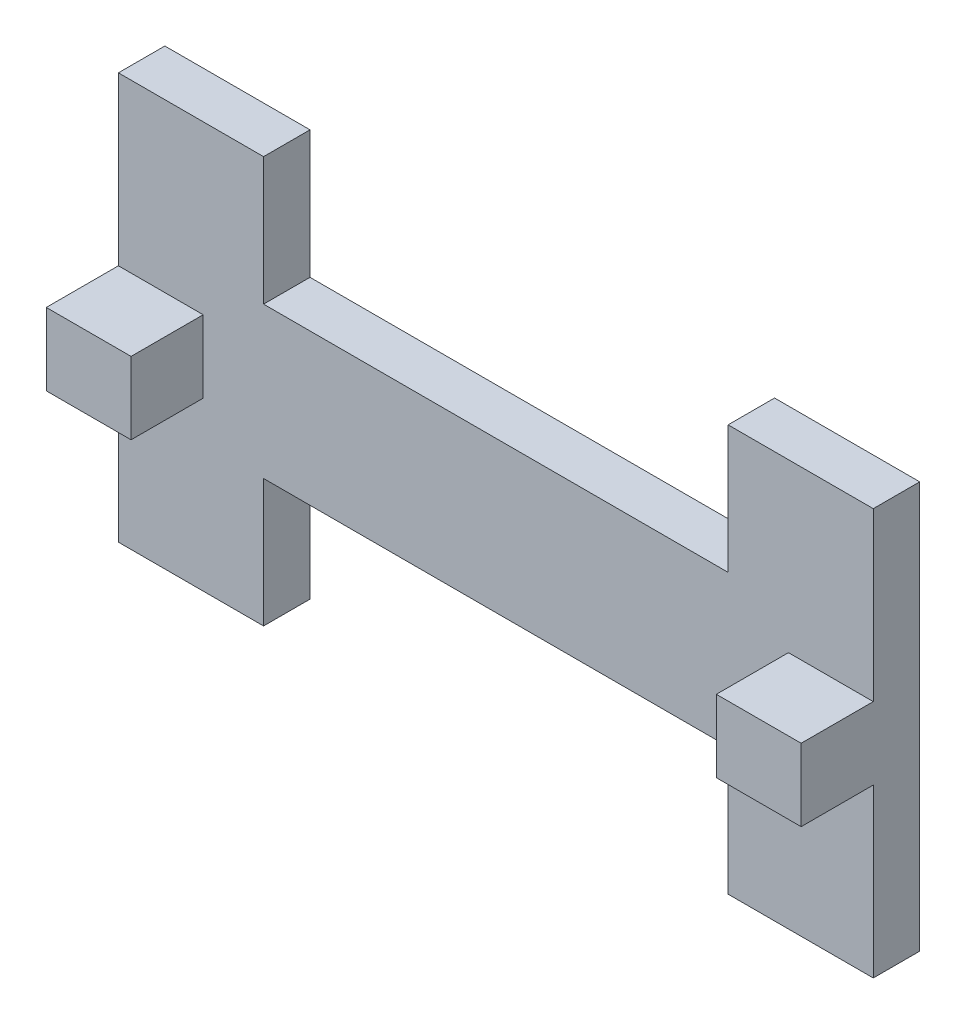
ISO-10303-21;
HEADER;
FILE_DESCRIPTION(('STEP AP214'),'2;1');
FILE_NAME('part.step','',(''),(''),'','','');
FILE_SCHEMA(('AUTOMOTIVE_DESIGN { 1 0 10303 214 1 1 1 1 }'));
ENDSEC;
DATA;
#1=APPLICATION_CONTEXT('core data for automotive mechanical design processes');
#2=APPLICATION_PROTOCOL_DEFINITION('international standard','automotive_design',2000,#1);
#3=PRODUCT_CONTEXT('',#1,'mechanical');
#4=PRODUCT('Part','Part','',(#3));
#5=PRODUCT_RELATED_PRODUCT_CATEGORY('part','',(#4));
#6=PRODUCT_DEFINITION_FORMATION('','',#4);
#7=PRODUCT_DEFINITION_CONTEXT('part definition',#1,'design');
#8=PRODUCT_DEFINITION('design','',#6,#7);
#9=PRODUCT_DEFINITION_SHAPE('','',#8);
#10=(LENGTH_UNIT() NAMED_UNIT(*) SI_UNIT(.MILLI.,.METRE.));
#11=(NAMED_UNIT(*) PLANE_ANGLE_UNIT() SI_UNIT($,.RADIAN.));
#12=(NAMED_UNIT(*) SI_UNIT($,.STERADIAN.) SOLID_ANGLE_UNIT());
#13=UNCERTAINTY_MEASURE_WITH_UNIT(LENGTH_MEASURE(1.E-05),#10,'distance_accuracy_value','');
#14=(GEOMETRIC_REPRESENTATION_CONTEXT(3) GLOBAL_UNCERTAINTY_ASSIGNED_CONTEXT((#13)) GLOBAL_UNIT_ASSIGNED_CONTEXT((#10,
#11,#12)) REPRESENTATION_CONTEXT('',''));
#15=CARTESIAN_POINT('',(0.,0.,0.));
#16=DIRECTION('',(0.,0.,1.));
#17=DIRECTION('',(1.,0.,0.));
#18=AXIS2_PLACEMENT_3D('',#15,#16,#17);
#19=CARTESIAN_POINT('',(101.385445296764,-16.3782409065663,-42.7492999345452));
#20=DIRECTION('',(1.,0.,0.));
#21=DIRECTION('',(0.,0.,-1.));
#22=AXIS2_PLACEMENT_3D('',#19,#20,#21);
#23=PLANE('',#22);
#24=DIRECTION('',(0.,1.,0.));
#25=VECTOR('',#24,1.);
#26=CARTESIAN_POINT('',(101.385445296764,-16.3782409065663,-34.7492999345452));
#27=LINE('',#26,#25);
#28=CARTESIAN_POINT('',(101.385445296764,-27.3782409065664,-34.7492999345452));
#29=VERTEX_POINT('',#28);
#30=CARTESIAN_POINT('',(101.385445296764,-5.37824090656635,-34.7492999345452));
#31=VERTEX_POINT('',#30);
#32=EDGE_CURVE('E11',#29,#31,#27,.T.);
#33=ORIENTED_EDGE('',*,*,#32,.T.);
#34=DIRECTION('',(0.,0.,1.));
#35=VECTOR('',#34,1.);
#36=CARTESIAN_POINT('',(101.385445296764,-5.37824090656634,-42.7492999345452));
#37=LINE('',#36,#35);
#38=CARTESIAN_POINT('',(101.385445296764,-5.37824090656634,-42.7492999345452));
#39=VERTEX_POINT('',#38);
#40=EDGE_CURVE('E24',#39,#31,#37,.T.);
#41=ORIENTED_EDGE('',*,*,#40,.F.);
#42=DIRECTION('',(0.,1.,0.));
#43=VECTOR('',#42,1.);
#44=CARTESIAN_POINT('',(101.385445296764,-16.3782409065663,-42.7492999345452));
#45=LINE('',#44,#43);
#46=CARTESIAN_POINT('',(101.385445296764,-27.3782409065664,-42.7492999345452));
#47=VERTEX_POINT('',#46);
#48=EDGE_CURVE('E307',#47,#39,#45,.T.);
#49=ORIENTED_EDGE('',*,*,#48,.F.);
#50=DIRECTION('',(0.,0.,1.));
#51=VECTOR('',#50,1.);
#52=CARTESIAN_POINT('',(101.385445296764,-27.3782409065664,-42.7492999345452));
#53=LINE('',#52,#51);
#54=EDGE_CURVE('E305',#47,#29,#53,.T.);
#55=ORIENTED_EDGE('',*,*,#54,.T.);
#56=EDGE_LOOP('',(#33,#41,#49,#55));
#57=FACE_BOUND('',#56,.T.);
#58=ADVANCED_FACE('F17',(#57),#23,.F.);
#59=CARTESIAN_POINT('',(81.3854452967644,-5.37824090656634,-42.7492999345452));
#60=DIRECTION('',(0.,1.,0.));
#61=DIRECTION('',(0.,0.,1.));
#62=AXIS2_PLACEMENT_3D('',#59,#60,#61);
#63=PLANE('',#62);
#64=DIRECTION('',(-1.,0.,0.));
#65=VECTOR('',#64,1.);
#66=CARTESIAN_POINT('',(81.3854452967644,-5.37824090656635,-34.7492999345452));
#67=LINE('',#66,#65);
#68=CARTESIAN_POINT('',(21.3854452967643,-5.37824090656635,-34.7492999345452));
#69=VERTEX_POINT('',#68);
#70=EDGE_CURVE('E303',#31,#69,#67,.T.);
#71=ORIENTED_EDGE('',*,*,#70,.T.);
#72=DIRECTION('',(0.,0.,1.));
#73=VECTOR('',#72,1.);
#74=CARTESIAN_POINT('',(21.3854452967643,-5.37824090656634,-42.7492999345452));
#75=LINE('',#74,#73);
#76=CARTESIAN_POINT('',(21.3854452967643,-5.37824090656634,-42.7492999345452));
#77=VERTEX_POINT('',#76);
#78=EDGE_CURVE('E300',#77,#69,#75,.T.);
#79=ORIENTED_EDGE('',*,*,#78,.F.);
#80=DIRECTION('',(-1.,0.,0.));
#81=VECTOR('',#80,1.);
#82=CARTESIAN_POINT('',(81.3854452967644,-5.37824090656634,-42.7492999345452));
#83=LINE('',#82,#81);
#84=EDGE_CURVE('E297',#39,#77,#83,.T.);
#85=ORIENTED_EDGE('',*,*,#84,.F.);
#86=ORIENTED_EDGE('',*,*,#40,.T.);
#87=EDGE_LOOP('',(#71,#79,#85,#86));
#88=FACE_BOUND('',#87,.T.);
#89=ADVANCED_FACE('F311',(#88),#63,.F.);
#90=CARTESIAN_POINT('',(81.3854452967644,20.6217590934336,-42.7492999345452));
#91=DIRECTION('',(0.,1.,0.));
#92=DIRECTION('',(0.,0.,1.));
#93=AXIS2_PLACEMENT_3D('',#90,#91,#92);
#94=PLANE('',#93);
#95=DIRECTION('',(-1.,0.,0.));
#96=VECTOR('',#95,1.);
#97=CARTESIAN_POINT('',(81.3854452967644,20.6217590934336,-34.7492999345452));
#98=LINE('',#97,#96);
#99=CARTESIAN_POINT('',(101.385445296764,20.6217590934336,-34.7492999345452));
#100=VERTEX_POINT('',#99);
#101=CARTESIAN_POINT('',(21.3854452967643,20.6217590934336,-34.7492999345452));
#102=VERTEX_POINT('',#101);
#103=EDGE_CURVE('E294',#100,#102,#98,.T.);
#104=ORIENTED_EDGE('',*,*,#103,.F.);
#105=DIRECTION('',(0.,0.,1.));
#106=VECTOR('',#105,1.);
#107=CARTESIAN_POINT('',(101.385445296764,20.6217590934336,-42.7492999345452));
#108=LINE('',#107,#106);
#109=CARTESIAN_POINT('',(101.385445296764,20.6217590934336,-42.7492999345452));
#110=VERTEX_POINT('',#109);
#111=EDGE_CURVE('E291',#110,#100,#108,.T.);
#112=ORIENTED_EDGE('',*,*,#111,.F.);
#113=DIRECTION('',(-1.,0.,0.));
#114=VECTOR('',#113,1.);
#115=CARTESIAN_POINT('',(81.3854452967644,20.6217590934336,-42.7492999345452));
#116=LINE('',#115,#114);
#117=CARTESIAN_POINT('',(21.3854452967643,20.6217590934336,-42.7492999345452));
#118=VERTEX_POINT('',#117);
#119=EDGE_CURVE('E289',#110,#118,#116,.T.);
#120=ORIENTED_EDGE('',*,*,#119,.T.);
#121=DIRECTION('',(0.,0.,1.));
#122=VECTOR('',#121,1.);
#123=CARTESIAN_POINT('',(21.3854452967643,20.6217590934336,-42.7492999345452));
#124=LINE('',#123,#122);
#125=EDGE_CURVE('E287',#118,#102,#124,.T.);
#126=ORIENTED_EDGE('',*,*,#125,.T.);
#127=EDGE_LOOP('',(#104,#112,#120,#126));
#128=FACE_BOUND('',#127,.T.);
#129=ADVANCED_FACE('F360',(#128),#94,.T.);
#130=CARTESIAN_POINT('',(101.385445296764,31.6217590934336,-42.7492999345451));
#131=DIRECTION('',(1.,0.,0.));
#132=DIRECTION('',(0.,0.,-1.));
#133=AXIS2_PLACEMENT_3D('',#130,#131,#132);
#134=PLANE('',#133);
#135=DIRECTION('',(0.,1.,0.));
#136=VECTOR('',#135,1.);
#137=CARTESIAN_POINT('',(101.385445296764,31.6217590934336,-34.7492999345451));
#138=LINE('',#137,#136);
#139=CARTESIAN_POINT('',(101.385445296764,42.6217590934337,-34.7492999345451));
#140=VERTEX_POINT('',#139);
#141=EDGE_CURVE('E285',#100,#140,#138,.T.);
#142=ORIENTED_EDGE('',*,*,#141,.T.);
#143=DIRECTION('',(0.,0.,1.));
#144=VECTOR('',#143,1.);
#145=CARTESIAN_POINT('',(101.385445296764,42.6217590934337,-42.7492999345451));
#146=LINE('',#145,#144);
#147=CARTESIAN_POINT('',(101.385445296764,42.6217590934337,-42.7492999345451));
#148=VERTEX_POINT('',#147);
#149=EDGE_CURVE('E282',#148,#140,#146,.T.);
#150=ORIENTED_EDGE('',*,*,#149,.F.);
#151=DIRECTION('',(0.,1.,0.));
#152=VECTOR('',#151,1.);
#153=CARTESIAN_POINT('',(101.385445296764,31.6217590934336,-42.7492999345451));
#154=LINE('',#153,#152);
#155=EDGE_CURVE('E279',#110,#148,#154,.T.);
#156=ORIENTED_EDGE('',*,*,#155,.F.);
#157=ORIENTED_EDGE('',*,*,#111,.T.);
#158=EDGE_LOOP('',(#142,#150,#156,#157));
#159=FACE_BOUND('',#158,.T.);
#160=ADVANCED_FACE('F364',(#159),#134,.F.);
#161=CARTESIAN_POINT('',(113.885445296764,42.6217590934337,-42.7492999345451));
#162=DIRECTION('',(0.,-1.,0.));
#163=DIRECTION('',(0.,0.,-1.));
#164=AXIS2_PLACEMENT_3D('',#161,#162,#163);
#165=PLANE('',#164);
#166=DIRECTION('',(1.,0.,0.));
#167=VECTOR('',#166,1.);
#168=CARTESIAN_POINT('',(113.885445296764,42.6217590934337,-34.7492999345451));
#169=LINE('',#168,#167);
#170=CARTESIAN_POINT('',(126.385445296764,42.6217590934337,-34.7492999345451));
#171=VERTEX_POINT('',#170);
#172=EDGE_CURVE('E277',#140,#171,#169,.T.);
#173=ORIENTED_EDGE('',*,*,#172,.T.);
#174=DIRECTION('',(0.,0.,1.));
#175=VECTOR('',#174,1.);
#176=CARTESIAN_POINT('',(126.385445296764,42.6217590934337,-42.7492999345451));
#177=LINE('',#176,#175);
#178=CARTESIAN_POINT('',(126.385445296764,42.6217590934337,-42.7492999345451));
#179=VERTEX_POINT('',#178);
#180=EDGE_CURVE('E274',#179,#171,#177,.T.);
#181=ORIENTED_EDGE('',*,*,#180,.F.);
#182=DIRECTION('',(1.,0.,0.));
#183=VECTOR('',#182,1.);
#184=CARTESIAN_POINT('',(113.885445296764,42.6217590934337,-42.7492999345451));
#185=LINE('',#184,#183);
#186=EDGE_CURVE('E271',#148,#179,#185,.T.);
#187=ORIENTED_EDGE('',*,*,#186,.F.);
#188=ORIENTED_EDGE('',*,*,#149,.T.);
#189=EDGE_LOOP('',(#173,#181,#187,#188));
#190=FACE_BOUND('',#189,.T.);
#191=ADVANCED_FACE('F370',(#190),#165,.F.);
#192=CARTESIAN_POINT('',(126.385445296764,-12.9889434065663,-42.7492999345452));
#193=DIRECTION('',(1.,0.,0.));
#194=DIRECTION('',(0.,0.,-1.));
#195=AXIS2_PLACEMENT_3D('',#192,#193,#194);
#196=PLANE('',#195);
#197=DIRECTION('',(0.,1.,0.));
#198=VECTOR('',#197,1.);
#199=CARTESIAN_POINT('',(126.385445296764,-12.9889434065663,-34.7492999345452));
#200=LINE('',#199,#198);
#201=CARTESIAN_POINT('',(126.385445296764,-27.3782409065664,-34.7492999345452));
#202=VERTEX_POINT('',#201);
#203=CARTESIAN_POINT('',(126.385445296764,1.40035409343365,-34.7492999345452));
#204=VERTEX_POINT('',#203);
#205=EDGE_CURVE('E268',#202,#204,#200,.T.);
#206=ORIENTED_EDGE('',*,*,#205,.F.);
#207=DIRECTION('',(0.,0.,1.));
#208=VECTOR('',#207,1.);
#209=CARTESIAN_POINT('',(126.385445296764,-27.3782409065664,-42.7492999345452));
#210=LINE('',#209,#208);
#211=CARTESIAN_POINT('',(126.385445296764,-27.3782409065664,-42.7492999345452));
#212=VERTEX_POINT('',#211);
#213=EDGE_CURVE('E265',#212,#202,#210,.T.);
#214=ORIENTED_EDGE('',*,*,#213,.F.);
#215=DIRECTION('',(0.,1.,0.));
#216=VECTOR('',#215,1.);
#217=CARTESIAN_POINT('',(126.385445296764,28.2324615934337,-42.7492999345451));
#218=LINE('',#217,#216);
#219=EDGE_CURVE('E262',#212,#179,#218,.T.);
#220=ORIENTED_EDGE('',*,*,#219,.T.);
#221=ORIENTED_EDGE('',*,*,#180,.T.);
#222=CARTESIAN_POINT('',(126.385445296764,13.8431640934336,-34.7492999345452));
#223=VERTEX_POINT('',#222);
#224=EDGE_CURVE('E261',#223,#171,#200,.T.);
#225=ORIENTED_EDGE('',*,*,#224,.F.);
#226=DIRECTION('',(0.,0.,-1.));
#227=VECTOR('',#226,1.);
#228=CARTESIAN_POINT('',(126.385445296764,13.8431640934336,-22.3263341014015));
#229=LINE('',#228,#227);
#230=CARTESIAN_POINT('',(126.385445296764,13.8431640934336,-22.3283341014015));
#231=VERTEX_POINT('',#230);
#232=EDGE_CURVE('E258',#231,#223,#229,.T.);
#233=ORIENTED_EDGE('',*,*,#232,.F.);
#234=DIRECTION('',(0.,-1.,0.));
#235=VECTOR('',#234,1.);
#236=CARTESIAN_POINT('',(126.385445296764,4.51105659343364,-22.3283341014015));
#237=LINE('',#236,#235);
#238=CARTESIAN_POINT('',(126.385445296764,1.40035409343364,-22.3283341014015));
#239=VERTEX_POINT('',#238);
#240=EDGE_CURVE('E256',#231,#239,#237,.T.);
#241=ORIENTED_EDGE('',*,*,#240,.T.);
#242=DIRECTION('',(0.,0.,-1.));
#243=VECTOR('',#242,1.);
#244=CARTESIAN_POINT('',(126.385445296764,1.40035409343364,-22.3263341014015));
#245=LINE('',#244,#243);
#246=EDGE_CURVE('E254',#239,#204,#245,.T.);
#247=ORIENTED_EDGE('',*,*,#246,.T.);
#248=EDGE_LOOP('',(#206,#214,#220,#221,#225,#233,#241,#247));
#249=FACE_BOUND('',#248,.T.);
#250=ADVANCED_FACE('F344',(#249),#196,.T.);
#251=CARTESIAN_POINT('',(113.885445296764,-27.3782409065664,-42.7492999345452));
#252=DIRECTION('',(0.,-1.,0.));
#253=DIRECTION('',(0.,0.,-1.));
#254=AXIS2_PLACEMENT_3D('',#251,#252,#253);
#255=PLANE('',#254);
#256=DIRECTION('',(1.,0.,0.));
#257=VECTOR('',#256,1.);
#258=CARTESIAN_POINT('',(113.885445296764,-27.3782409065664,-34.7492999345452));
#259=LINE('',#258,#257);
#260=EDGE_CURVE('E251',#29,#202,#259,.T.);
#261=ORIENTED_EDGE('',*,*,#260,.F.);
#262=ORIENTED_EDGE('',*,*,#54,.F.);
#263=DIRECTION('',(1.,0.,0.));
#264=VECTOR('',#263,1.);
#265=CARTESIAN_POINT('',(113.885445296764,-27.3782409065664,-42.7492999345452));
#266=LINE('',#265,#264);
#267=EDGE_CURVE('E248',#47,#212,#266,.T.);
#268=ORIENTED_EDGE('',*,*,#267,.T.);
#269=ORIENTED_EDGE('',*,*,#213,.T.);
#270=EDGE_LOOP('',(#261,#262,#268,#269));
#271=FACE_BOUND('',#270,.T.);
#272=ADVANCED_FACE('F326',(#271),#255,.T.);
#273=CARTESIAN_POINT('',(82.5630103051663,7.62175909343366,-42.7492999345452));
#274=DIRECTION('',(0.,0.,-1.));
#275=DIRECTION('',(1.,0.,0.));
#276=AXIS2_PLACEMENT_3D('',#273,#274,#275);
#277=PLANE('',#276);
#278=ORIENTED_EDGE('',*,*,#48,.T.);
#279=ORIENTED_EDGE('',*,*,#84,.T.);
#280=DIRECTION('',(0.,1.,0.));
#281=VECTOR('',#280,1.);
#282=CARTESIAN_POINT('',(21.3854452967643,-16.3782409065663,-42.7492999345452));
#283=LINE('',#282,#281);
#284=CARTESIAN_POINT('',(21.3854452967643,-27.3782409065664,-42.7492999345452));
#285=VERTEX_POINT('',#284);
#286=EDGE_CURVE('E245',#285,#77,#283,.T.);
#287=ORIENTED_EDGE('',*,*,#286,.F.);
#288=DIRECTION('',(-1.,0.,0.));
#289=VECTOR('',#288,1.);
#290=CARTESIAN_POINT('',(8.88544529676437,-27.3782409065664,-42.7492999345452));
#291=LINE('',#290,#289);
#292=CARTESIAN_POINT('',(-3.61455470323563,-27.3782409065664,-42.7492999345452));
#293=VERTEX_POINT('',#292);
#294=EDGE_CURVE('E243',#285,#293,#291,.T.);
#295=ORIENTED_EDGE('',*,*,#294,.T.);
#296=DIRECTION('',(0.,1.,0.));
#297=VECTOR('',#296,1.);
#298=CARTESIAN_POINT('',(-3.61455470323563,28.2324615934337,-42.7492999345451));
#299=LINE('',#298,#297);
#300=CARTESIAN_POINT('',(-3.61455470323563,42.6217590934337,-42.7492999345451));
#301=VERTEX_POINT('',#300);
#302=EDGE_CURVE('E241',#293,#301,#299,.T.);
#303=ORIENTED_EDGE('',*,*,#302,.T.);
#304=DIRECTION('',(-1.,0.,0.));
#305=VECTOR('',#304,1.);
#306=CARTESIAN_POINT('',(8.88544529676436,42.6217590934337,-42.7492999345451));
#307=LINE('',#306,#305);
#308=CARTESIAN_POINT('',(21.3854452967643,42.6217590934337,-42.7492999345451));
#309=VERTEX_POINT('',#308);
#310=EDGE_CURVE('E238',#309,#301,#307,.T.);
#311=ORIENTED_EDGE('',*,*,#310,.F.);
#312=DIRECTION('',(0.,1.,0.));
#313=VECTOR('',#312,1.);
#314=CARTESIAN_POINT('',(21.3854452967643,31.6217590934336,-42.7492999345451));
#315=LINE('',#314,#313);
#316=EDGE_CURVE('E235',#118,#309,#315,.T.);
#317=ORIENTED_EDGE('',*,*,#316,.F.);
#318=ORIENTED_EDGE('',*,*,#119,.F.);
#319=ORIENTED_EDGE('',*,*,#155,.T.);
#320=ORIENTED_EDGE('',*,*,#186,.T.);
#321=ORIENTED_EDGE('',*,*,#219,.F.);
#322=ORIENTED_EDGE('',*,*,#267,.F.);
#323=EDGE_LOOP('',(#278,#279,#287,#295,#303,#311,#317,#318,#319,#320,#321,#322));
#324=FACE_BOUND('',#323,.T.);
#325=ADVANCED_FACE('F320',(#324),#277,.T.);
#326=CARTESIAN_POINT('',(82.5630103051663,7.62175909343365,-34.7492999345452));
#327=DIRECTION('',(0.,0.,-1.));
#328=DIRECTION('',(1.,0.,0.));
#329=AXIS2_PLACEMENT_3D('',#326,#327,#328);
#330=PLANE('',#329);
#331=ORIENTED_EDGE('',*,*,#205,.T.);
#332=DIRECTION('',(-1.,0.,0.));
#333=VECTOR('',#332,1.);
#334=CARTESIAN_POINT('',(119.083506315947,1.40035409343365,-34.7492999345452));
#335=LINE('',#334,#333);
#336=CARTESIAN_POINT('',(111.781567335129,1.40035409343365,-34.7492999345452));
#337=VERTEX_POINT('',#336);
#338=EDGE_CURVE('E233',#204,#337,#335,.T.);
#339=ORIENTED_EDGE('',*,*,#338,.T.);
#340=DIRECTION('',(0.,1.,0.));
#341=VECTOR('',#340,1.);
#342=CARTESIAN_POINT('',(111.781567335129,4.51105659343365,-34.7492999345452));
#343=LINE('',#342,#341);
#344=CARTESIAN_POINT('',(111.781567335129,13.8431640934336,-34.7492999345452));
#345=VERTEX_POINT('',#344);
#346=EDGE_CURVE('E231',#337,#345,#343,.T.);
#347=ORIENTED_EDGE('',*,*,#346,.T.);
#348=DIRECTION('',(-1.,0.,0.));
#349=VECTOR('',#348,1.);
#350=CARTESIAN_POINT('',(119.083506315947,13.8431640934336,-34.7492999345452));
#351=LINE('',#350,#349);
#352=EDGE_CURVE('E228',#223,#345,#351,.T.);
#353=ORIENTED_EDGE('',*,*,#352,.F.);
#354=ORIENTED_EDGE('',*,*,#224,.T.);
#355=ORIENTED_EDGE('',*,*,#172,.F.);
#356=ORIENTED_EDGE('',*,*,#141,.F.);
#357=ORIENTED_EDGE('',*,*,#103,.T.);
#358=DIRECTION('',(0.,1.,0.));
#359=VECTOR('',#358,1.);
#360=CARTESIAN_POINT('',(21.3854452967643,31.6217590934336,-34.7492999345451));
#361=LINE('',#360,#359);
#362=CARTESIAN_POINT('',(21.3854452967643,42.6217590934337,-34.7492999345451));
#363=VERTEX_POINT('',#362);
#364=EDGE_CURVE('E226',#102,#363,#361,.T.);
#365=ORIENTED_EDGE('',*,*,#364,.T.);
#366=DIRECTION('',(-1.,0.,0.));
#367=VECTOR('',#366,1.);
#368=CARTESIAN_POINT('',(8.88544529676436,42.6217590934337,-34.7492999345451));
#369=LINE('',#368,#367);
#370=CARTESIAN_POINT('',(-3.61455470323563,42.6217590934337,-34.7492999345451));
#371=VERTEX_POINT('',#370);
#372=EDGE_CURVE('E224',#363,#371,#369,.T.);
#373=ORIENTED_EDGE('',*,*,#372,.T.);
#374=DIRECTION('',(0.,1.,0.));
#375=VECTOR('',#374,1.);
#376=CARTESIAN_POINT('',(-3.61455470323563,-12.9889434065663,-34.7492999345452));
#377=LINE('',#376,#375);
#378=CARTESIAN_POINT('',(-3.61455470323563,13.8431640934336,-34.7492999345452));
#379=VERTEX_POINT('',#378);
#380=EDGE_CURVE('E221',#379,#371,#377,.T.);
#381=ORIENTED_EDGE('',*,*,#380,.F.);
#382=DIRECTION('',(1.,0.,0.));
#383=VECTOR('',#382,1.);
#384=CARTESIAN_POINT('',(3.68738427758217,13.8431640934336,-34.7492999345452));
#385=LINE('',#384,#383);
#386=CARTESIAN_POINT('',(10.9893232584,13.8431640934336,-34.7492999345452));
#387=VERTEX_POINT('',#386);
#388=EDGE_CURVE('E219',#379,#387,#385,.T.);
#389=ORIENTED_EDGE('',*,*,#388,.T.);
#390=DIRECTION('',(0.,1.,0.));
#391=VECTOR('',#390,1.);
#392=CARTESIAN_POINT('',(10.9893232584,4.51105659343365,-34.7492999345452));
#393=LINE('',#392,#391);
#394=CARTESIAN_POINT('',(10.9893232584,1.40035409343365,-34.7492999345452));
#395=VERTEX_POINT('',#394);
#396=EDGE_CURVE('E166',#395,#387,#393,.T.);
#397=ORIENTED_EDGE('',*,*,#396,.F.);
#398=DIRECTION('',(1.,0.,0.));
#399=VECTOR('',#398,1.);
#400=CARTESIAN_POINT('',(3.68738427758217,1.40035409343365,-34.7492999345452));
#401=LINE('',#400,#399);
#402=CARTESIAN_POINT('',(-3.61455470323563,1.40035409343365,-34.7492999345452));
#403=VERTEX_POINT('',#402);
#404=EDGE_CURVE('E215',#403,#395,#401,.T.);
#405=ORIENTED_EDGE('',*,*,#404,.F.);
#406=CARTESIAN_POINT('',(-3.61455470323563,-27.3782409065664,-34.7492999345452));
#407=VERTEX_POINT('',#406);
#408=EDGE_CURVE('E214',#407,#403,#377,.T.);
#409=ORIENTED_EDGE('',*,*,#408,.F.);
#410=DIRECTION('',(-1.,0.,0.));
#411=VECTOR('',#410,1.);
#412=CARTESIAN_POINT('',(8.88544529676437,-27.3782409065664,-34.7492999345452));
#413=LINE('',#412,#411);
#414=CARTESIAN_POINT('',(21.3854452967643,-27.3782409065664,-34.7492999345452));
#415=VERTEX_POINT('',#414);
#416=EDGE_CURVE('E211',#415,#407,#413,.T.);
#417=ORIENTED_EDGE('',*,*,#416,.F.);
#418=DIRECTION('',(0.,1.,0.));
#419=VECTOR('',#418,1.);
#420=CARTESIAN_POINT('',(21.3854452967643,-16.3782409065663,-34.7492999345452));
#421=LINE('',#420,#419);
#422=EDGE_CURVE('E208',#415,#69,#421,.T.);
#423=ORIENTED_EDGE('',*,*,#422,.T.);
#424=ORIENTED_EDGE('',*,*,#70,.F.);
#425=ORIENTED_EDGE('',*,*,#32,.F.);
#426=ORIENTED_EDGE('',*,*,#260,.T.);
#427=EDGE_LOOP('',(#331,#339,#347,#353,#354,#355,#356,#357,#365,#373,#381,#389,#397,#405,#409,
#417,#423,#424,#425,#426));
#428=FACE_BOUND('',#427,.T.);
#429=ADVANCED_FACE('F314',(#428),#330,.F.);
#430=CARTESIAN_POINT('',(111.815299274028,35.4431648433209,-22.3283341014015));
#431=DIRECTION('',(0.,0.,-1.));
#432=DIRECTION('',(0.,-1.,0.));
#433=AXIS2_PLACEMENT_3D('',#430,#431,#432);
#434=PLANE('',#433);
#435=DIRECTION('',(1.,0.,0.));
#436=VECTOR('',#435,1.);
#437=CARTESIAN_POINT('',(119.083506315947,13.8431640934336,-22.3283341014015));
#438=LINE('',#437,#436);
#439=CARTESIAN_POINT('',(111.781567335129,13.8431640934336,-22.3283341014015));
#440=VERTEX_POINT('',#439);
#441=EDGE_CURVE('E205',#440,#231,#438,.T.);
#442=ORIENTED_EDGE('',*,*,#441,.F.);
#443=DIRECTION('',(0.,-1.,0.));
#444=VECTOR('',#443,1.);
#445=CARTESIAN_POINT('',(111.781567335129,4.51105659343365,-22.3283341014015));
#446=LINE('',#445,#444);
#447=CARTESIAN_POINT('',(111.781567335129,1.40035409343365,-22.3283341014015));
#448=VERTEX_POINT('',#447);
#449=EDGE_CURVE('E203',#440,#448,#446,.T.);
#450=ORIENTED_EDGE('',*,*,#449,.T.);
#451=DIRECTION('',(1.,0.,0.));
#452=VECTOR('',#451,1.);
#453=CARTESIAN_POINT('',(119.083506315947,1.40035409343365,-22.3283341014015));
#454=LINE('',#453,#452);
#455=EDGE_CURVE('E200',#448,#239,#454,.T.);
#456=ORIENTED_EDGE('',*,*,#455,.T.);
#457=ORIENTED_EDGE('',*,*,#240,.F.);
#458=EDGE_LOOP('',(#442,#450,#456,#457));
#459=FACE_BOUND('',#458,.T.);
#460=ADVANCED_FACE('F346',(#459),#434,.F.);
#461=CARTESIAN_POINT('',(119.083506315947,1.40035409343365,-22.3263341014015));
#462=DIRECTION('',(0.,-1.,0.));
#463=DIRECTION('',(0.,0.,-1.));
#464=AXIS2_PLACEMENT_3D('',#461,#462,#463);
#465=PLANE('',#464);
#466=ORIENTED_EDGE('',*,*,#455,.F.);
#467=DIRECTION('',(0.,0.,-1.));
#468=VECTOR('',#467,1.);
#469=CARTESIAN_POINT('',(111.781567335129,1.40035409343365,-22.3263341014015));
#470=LINE('',#469,#468);
#471=EDGE_CURVE('E197',#448,#337,#470,.T.);
#472=ORIENTED_EDGE('',*,*,#471,.T.);
#473=ORIENTED_EDGE('',*,*,#338,.F.);
#474=ORIENTED_EDGE('',*,*,#246,.F.);
#475=EDGE_LOOP('',(#466,#472,#473,#474));
#476=FACE_BOUND('',#475,.T.);
#477=ADVANCED_FACE('F332',(#476),#465,.T.);
#478=CARTESIAN_POINT('',(111.781567335129,4.51105659343365,-22.3263341014015));
#479=DIRECTION('',(-1.,0.,0.));
#480=DIRECTION('',(0.,0.,1.));
#481=AXIS2_PLACEMENT_3D('',#478,#479,#480);
#482=PLANE('',#481);
#483=ORIENTED_EDGE('',*,*,#449,.F.);
#484=DIRECTION('',(0.,0.,-1.));
#485=VECTOR('',#484,1.);
#486=CARTESIAN_POINT('',(111.781567335129,13.8431640934336,-22.3263341014015));
#487=LINE('',#486,#485);
#488=EDGE_CURVE('E194',#440,#345,#487,.T.);
#489=ORIENTED_EDGE('',*,*,#488,.T.);
#490=ORIENTED_EDGE('',*,*,#346,.F.);
#491=ORIENTED_EDGE('',*,*,#471,.F.);
#492=EDGE_LOOP('',(#483,#489,#490,#491));
#493=FACE_BOUND('',#492,.T.);
#494=ADVANCED_FACE('F337',(#493),#482,.T.);
#495=CARTESIAN_POINT('',(119.083506315947,13.8431640934336,-22.3263341014015));
#496=DIRECTION('',(0.,-1.,0.));
#497=DIRECTION('',(0.,0.,-1.));
#498=AXIS2_PLACEMENT_3D('',#495,#496,#497);
#499=PLANE('',#498);
#500=ORIENTED_EDGE('',*,*,#488,.F.);
#501=ORIENTED_EDGE('',*,*,#441,.T.);
#502=ORIENTED_EDGE('',*,*,#232,.T.);
#503=ORIENTED_EDGE('',*,*,#352,.T.);
#504=EDGE_LOOP('',(#500,#501,#502,#503));
#505=FACE_BOUND('',#504,.T.);
#506=ADVANCED_FACE('F342',(#505),#499,.F.);
#507=CARTESIAN_POINT('',(21.3854452967643,-16.3782409065663,-42.7492999345452));
#508=DIRECTION('',(-1.,0.,0.));
#509=DIRECTION('',(0.,0.,-1.));
#510=AXIS2_PLACEMENT_3D('',#507,#508,#509);
#511=PLANE('',#510);
#512=ORIENTED_EDGE('',*,*,#422,.F.);
#513=DIRECTION('',(0.,0.,1.));
#514=VECTOR('',#513,1.);
#515=CARTESIAN_POINT('',(21.3854452967643,-27.3782409065664,-42.7492999345452));
#516=LINE('',#515,#514);
#517=EDGE_CURVE('E191',#285,#415,#516,.T.);
#518=ORIENTED_EDGE('',*,*,#517,.F.);
#519=ORIENTED_EDGE('',*,*,#286,.T.);
#520=ORIENTED_EDGE('',*,*,#78,.T.);
#521=EDGE_LOOP('',(#512,#518,#519,#520));
#522=FACE_BOUND('',#521,.T.);
#523=ADVANCED_FACE('F318',(#522),#511,.F.);
#524=CARTESIAN_POINT('',(21.3854452967643,31.6217590934336,-42.7492999345451));
#525=DIRECTION('',(-1.,0.,0.));
#526=DIRECTION('',(0.,0.,-1.));
#527=AXIS2_PLACEMENT_3D('',#524,#525,#526);
#528=PLANE('',#527);
#529=ORIENTED_EDGE('',*,*,#364,.F.);
#530=ORIENTED_EDGE('',*,*,#125,.F.);
#531=ORIENTED_EDGE('',*,*,#316,.T.);
#532=DIRECTION('',(0.,0.,1.));
#533=VECTOR('',#532,1.);
#534=CARTESIAN_POINT('',(21.3854452967643,42.6217590934337,-42.7492999345451));
#535=LINE('',#534,#533);
#536=EDGE_CURVE('E188',#309,#363,#535,.T.);
#537=ORIENTED_EDGE('',*,*,#536,.T.);
#538=EDGE_LOOP('',(#529,#530,#531,#537));
#539=FACE_BOUND('',#538,.T.);
#540=ADVANCED_FACE('F428',(#539),#528,.F.);
#541=CARTESIAN_POINT('',(8.88544529676436,42.6217590934337,-42.7492999345451));
#542=DIRECTION('',(0.,-1.,0.));
#543=DIRECTION('',(0.,0.,-1.));
#544=AXIS2_PLACEMENT_3D('',#541,#542,#543);
#545=PLANE('',#544);
#546=ORIENTED_EDGE('',*,*,#372,.F.);
#547=ORIENTED_EDGE('',*,*,#536,.F.);
#548=ORIENTED_EDGE('',*,*,#310,.T.);
#549=DIRECTION('',(0.,0.,1.));
#550=VECTOR('',#549,1.);
#551=CARTESIAN_POINT('',(-3.61455470323563,42.6217590934337,-42.7492999345451));
#552=LINE('',#551,#550);
#553=EDGE_CURVE('E185',#301,#371,#552,.T.);
#554=ORIENTED_EDGE('',*,*,#553,.T.);
#555=EDGE_LOOP('',(#546,#547,#548,#554));
#556=FACE_BOUND('',#555,.T.);
#557=ADVANCED_FACE('F437',(#556),#545,.F.);
#558=CARTESIAN_POINT('',(-3.61455470323563,-12.9889434065663,-42.7492999345452));
#559=DIRECTION('',(-1.,0.,0.));
#560=DIRECTION('',(0.,0.,-1.));
#561=AXIS2_PLACEMENT_3D('',#558,#559,#560);
#562=PLANE('',#561);
#563=ORIENTED_EDGE('',*,*,#408,.T.);
#564=DIRECTION('',(0.,0.,-1.));
#565=VECTOR('',#564,1.);
#566=CARTESIAN_POINT('',(-3.61455470323563,1.40035409343364,-22.3263341014015));
#567=LINE('',#566,#565);
#568=CARTESIAN_POINT('',(-3.61455470323563,1.40035409343364,-22.3283341014015));
#569=VERTEX_POINT('',#568);
#570=EDGE_CURVE('E182',#569,#403,#567,.T.);
#571=ORIENTED_EDGE('',*,*,#570,.F.);
#572=DIRECTION('',(0.,-1.,0.));
#573=VECTOR('',#572,1.);
#574=CARTESIAN_POINT('',(-3.61455470323563,4.51105659343364,-22.3283341014015));
#575=LINE('',#574,#573);
#576=CARTESIAN_POINT('',(-3.61455470323563,13.8431640934336,-22.3283341014015));
#577=VERTEX_POINT('',#576);
#578=EDGE_CURVE('E180',#577,#569,#575,.T.);
#579=ORIENTED_EDGE('',*,*,#578,.F.);
#580=DIRECTION('',(0.,0.,-1.));
#581=VECTOR('',#580,1.);
#582=CARTESIAN_POINT('',(-3.61455470323563,13.8431640934336,-22.3263341014015));
#583=LINE('',#582,#581);
#584=EDGE_CURVE('E172',#577,#379,#583,.T.);
#585=ORIENTED_EDGE('',*,*,#584,.T.);
#586=ORIENTED_EDGE('',*,*,#380,.T.);
#587=ORIENTED_EDGE('',*,*,#553,.F.);
#588=ORIENTED_EDGE('',*,*,#302,.F.);
#589=DIRECTION('',(0.,0.,1.));
#590=VECTOR('',#589,1.);
#591=CARTESIAN_POINT('',(-3.61455470323563,-27.3782409065664,-42.7492999345452));
#592=LINE('',#591,#590);
#593=EDGE_CURVE('E173',#293,#407,#592,.T.);
#594=ORIENTED_EDGE('',*,*,#593,.T.);
#595=EDGE_LOOP('',(#563,#571,#579,#585,#586,#587,#588,#594));
#596=FACE_BOUND('',#595,.T.);
#597=ADVANCED_FACE('F447',(#596),#562,.T.);
#598=CARTESIAN_POINT('',(8.88544529676437,-27.3782409065664,-42.7492999345452));
#599=DIRECTION('',(0.,-1.,0.));
#600=DIRECTION('',(0.,0.,-1.));
#601=AXIS2_PLACEMENT_3D('',#598,#599,#600);
#602=PLANE('',#601);
#603=ORIENTED_EDGE('',*,*,#416,.T.);
#604=ORIENTED_EDGE('',*,*,#593,.F.);
#605=ORIENTED_EDGE('',*,*,#294,.F.);
#606=ORIENTED_EDGE('',*,*,#517,.T.);
#607=EDGE_LOOP('',(#603,#604,#605,#606));
#608=FACE_BOUND('',#607,.T.);
#609=ADVANCED_FACE('F457',(#608),#602,.T.);
#610=CARTESIAN_POINT('',(10.9555913195011,35.4431648433209,-22.3283341014015));
#611=DIRECTION('',(0.,0.,-1.));
#612=DIRECTION('',(0.,-1.,0.));
#613=AXIS2_PLACEMENT_3D('',#610,#611,#612);
#614=PLANE('',#613);
#615=DIRECTION('',(-1.,0.,0.));
#616=VECTOR('',#615,1.);
#617=CARTESIAN_POINT('',(3.68738427758217,13.8431640934336,-22.3283341014015));
#618=LINE('',#617,#616);
#619=CARTESIAN_POINT('',(10.9893232584,13.8431640934336,-22.3283341014015));
#620=VERTEX_POINT('',#619);
#621=EDGE_CURVE('E153',#620,#577,#618,.T.);
#622=ORIENTED_EDGE('',*,*,#621,.T.);
#623=ORIENTED_EDGE('',*,*,#578,.T.);
#624=DIRECTION('',(-1.,0.,0.));
#625=VECTOR('',#624,1.);
#626=CARTESIAN_POINT('',(3.68738427758217,1.40035409343365,-22.3283341014015));
#627=LINE('',#626,#625);
#628=CARTESIAN_POINT('',(10.9893232584,1.40035409343365,-22.3283341014015));
#629=VERTEX_POINT('',#628);
#630=EDGE_CURVE('E156',#629,#569,#627,.T.);
#631=ORIENTED_EDGE('',*,*,#630,.F.);
#632=DIRECTION('',(0.,-1.,0.));
#633=VECTOR('',#632,1.);
#634=CARTESIAN_POINT('',(10.9893232584,4.51105659343365,-22.3283341014015));
#635=LINE('',#634,#633);
#636=EDGE_CURVE('E148',#620,#629,#635,.T.);
#637=ORIENTED_EDGE('',*,*,#636,.F.);
#638=EDGE_LOOP('',(#622,#623,#631,#637));
#639=FACE_BOUND('',#638,.T.);
#640=ADVANCED_FACE('F150',(#639),#614,.F.);
#641=CARTESIAN_POINT('',(3.68738427758217,1.40035409343365,-22.3263341014015));
#642=DIRECTION('',(0.,-1.,0.));
#643=DIRECTION('',(0.,0.,-1.));
#644=AXIS2_PLACEMENT_3D('',#641,#642,#643);
#645=PLANE('',#644);
#646=ORIENTED_EDGE('',*,*,#630,.T.);
#647=ORIENTED_EDGE('',*,*,#570,.T.);
#648=ORIENTED_EDGE('',*,*,#404,.T.);
#649=DIRECTION('',(0.,0.,-1.));
#650=VECTOR('',#649,1.);
#651=CARTESIAN_POINT('',(10.9893232584,1.40035409343365,-22.3263341014015));
#652=LINE('',#651,#650);
#653=EDGE_CURVE('E160',#629,#395,#652,.T.);
#654=ORIENTED_EDGE('',*,*,#653,.F.);
#655=EDGE_LOOP('',(#646,#647,#648,#654));
#656=FACE_BOUND('',#655,.T.);
#657=ADVANCED_FACE('F476',(#656),#645,.T.);
#658=CARTESIAN_POINT('',(10.9893232584,4.51105659343365,-22.3263341014015));
#659=DIRECTION('',(1.,0.,0.));
#660=DIRECTION('',(0.,0.,1.));
#661=AXIS2_PLACEMENT_3D('',#658,#659,#660);
#662=PLANE('',#661);
#663=ORIENTED_EDGE('',*,*,#636,.T.);
#664=ORIENTED_EDGE('',*,*,#653,.T.);
#665=ORIENTED_EDGE('',*,*,#396,.T.);
#666=DIRECTION('',(0.,0.,-1.));
#667=VECTOR('',#666,1.);
#668=CARTESIAN_POINT('',(10.9893232584,13.8431640934336,-22.3263341014015));
#669=LINE('',#668,#667);
#670=EDGE_CURVE('E164',#620,#387,#669,.T.);
#671=ORIENTED_EDGE('',*,*,#670,.F.);
#672=EDGE_LOOP('',(#663,#664,#665,#671));
#673=FACE_BOUND('',#672,.T.);
#674=ADVANCED_FACE('F165',(#673),#662,.T.);
#675=CARTESIAN_POINT('',(3.68738427758217,13.8431640934336,-22.3263341014015));
#676=DIRECTION('',(0.,-1.,0.));
#677=DIRECTION('',(0.,0.,-1.));
#678=AXIS2_PLACEMENT_3D('',#675,#676,#677);
#679=PLANE('',#678);
#680=ORIENTED_EDGE('',*,*,#670,.T.);
#681=ORIENTED_EDGE('',*,*,#388,.F.);
#682=ORIENTED_EDGE('',*,*,#584,.F.);
#683=ORIENTED_EDGE('',*,*,#621,.F.);
#684=EDGE_LOOP('',(#680,#681,#682,#683));
#685=FACE_BOUND('',#684,.T.);
#686=ADVANCED_FACE('F170',(#685),#679,.F.);
#687=CLOSED_SHELL('',(#58,#89,#129,#160,#191,#250,#272,#325,#429,#460,#477,#494,#506,#523,#540,
#557,#597,#609,#640,#657,#674,#686));
#688=MANIFOLD_SOLID_BREP('B1',#687);
#689=ADVANCED_BREP_SHAPE_REPRESENTATION('',(#18,#688),#14);
#690=SHAPE_DEFINITION_REPRESENTATION(#9,#689);
ENDSEC;
END-ISO-10303-21;
